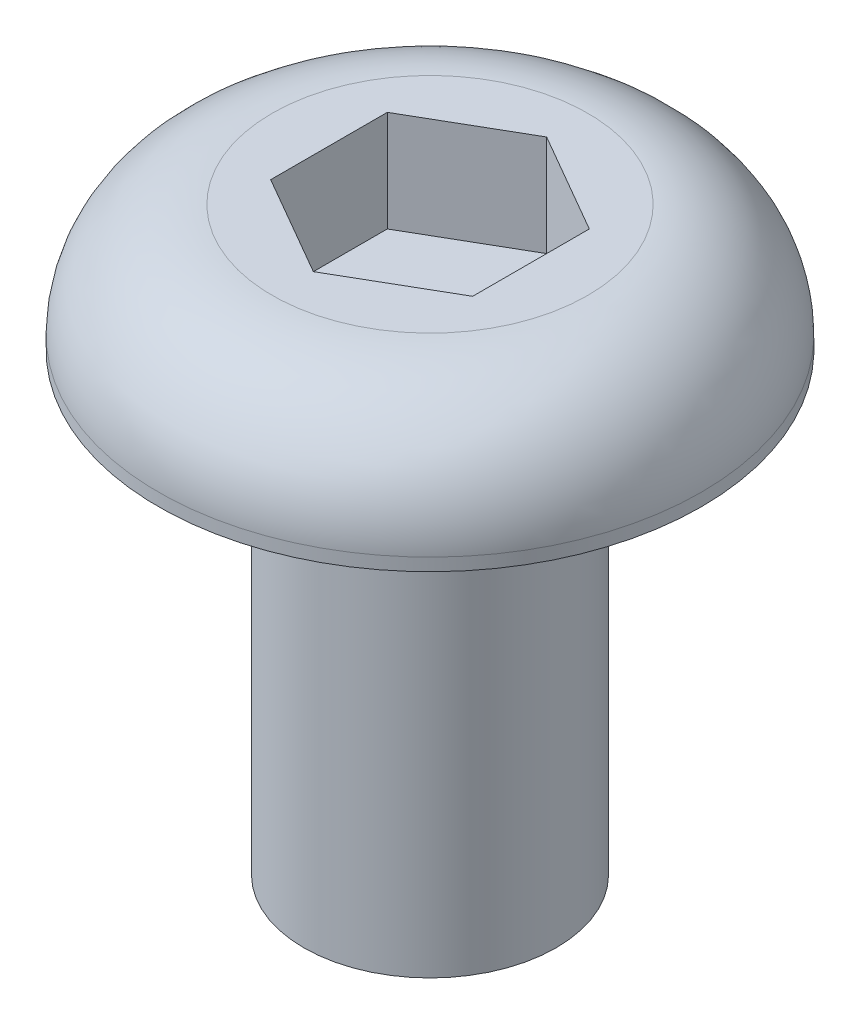
ISO-10303-21;
HEADER;
FILE_DESCRIPTION(('STEP AP214'),'2;1');
FILE_NAME('part.step','',(''),(''),'','','');
FILE_SCHEMA(('AUTOMOTIVE_DESIGN { 1 0 10303 214 1 1 1 1 }'));
ENDSEC;
DATA;
#1=APPLICATION_CONTEXT('core data for automotive mechanical design processes');
#2=APPLICATION_PROTOCOL_DEFINITION('international standard','automotive_design',2000,#1);
#3=PRODUCT_CONTEXT('',#1,'mechanical');
#4=PRODUCT('Part','Part','',(#3));
#5=PRODUCT_RELATED_PRODUCT_CATEGORY('part','',(#4));
#6=PRODUCT_DEFINITION_FORMATION('','',#4);
#7=PRODUCT_DEFINITION_CONTEXT('part definition',#1,'design');
#8=PRODUCT_DEFINITION('design','',#6,#7);
#9=PRODUCT_DEFINITION_SHAPE('','',#8);
#10=(LENGTH_UNIT() NAMED_UNIT(*) SI_UNIT(.MILLI.,.METRE.));
#11=(NAMED_UNIT(*) PLANE_ANGLE_UNIT() SI_UNIT($,.RADIAN.));
#12=(NAMED_UNIT(*) SI_UNIT($,.STERADIAN.) SOLID_ANGLE_UNIT());
#13=UNCERTAINTY_MEASURE_WITH_UNIT(LENGTH_MEASURE(1.E-05),#10,'distance_accuracy_value','');
#14=(GEOMETRIC_REPRESENTATION_CONTEXT(3) GLOBAL_UNCERTAINTY_ASSIGNED_CONTEXT((#13)) GLOBAL_UNIT_ASSIGNED_CONTEXT((#10,
#11,#12)) REPRESENTATION_CONTEXT('',''));
#15=CARTESIAN_POINT('',(0.,0.,0.));
#16=DIRECTION('',(0.,0.,1.));
#17=DIRECTION('',(1.,0.,0.));
#18=AXIS2_PLACEMENT_3D('',#15,#16,#17);
#19=CARTESIAN_POINT('',(0.,0.,0.));
#20=DIRECTION('',(0.,1.,0.));
#21=DIRECTION('',(-1.,0.,0.));
#22=AXIS2_PLACEMENT_3D('',#19,#20,#21);
#23=PLANE('',#22);
#24=CARTESIAN_POINT('',(0.,0.,0.));
#25=DIRECTION('',(0.,1.,0.));
#26=DIRECTION('',(-1.,0.,0.));
#27=AXIS2_PLACEMENT_3D('',#24,#25,#26);
#28=CIRCLE('',#27,5.);
#29=CARTESIAN_POINT('',(-5.,0.,0.));
#30=VERTEX_POINT('',#29);
#31=EDGE_CURVE('E11',#30,#30,#28,.T.);
#32=ORIENTED_EDGE('',*,*,#31,.F.);
#33=EDGE_LOOP('',(#32));
#34=FACE_BOUND('',#33,.T.);
#35=ADVANCED_FACE('F33',(#34),#23,.F.);
#36=CARTESIAN_POINT('',(0.,23.,0.));
#37=DIRECTION('',(0.,1.,0.));
#38=DIRECTION('',(-1.,0.,0.));
#39=AXIS2_PLACEMENT_3D('',#36,#37,#38);
#40=CYLINDRICAL_SURFACE('',#39,5.);
#41=CARTESIAN_POINT('',(0.,18.,0.));
#42=DIRECTION('',(0.,1.,0.));
#43=DIRECTION('',(-1.,0.,0.));
#44=AXIS2_PLACEMENT_3D('',#41,#42,#43);
#45=CIRCLE('',#44,5.);
#46=CARTESIAN_POINT('',(-5.,18.,0.));
#47=VERTEX_POINT('',#46);
#48=EDGE_CURVE('E40',#47,#47,#45,.T.);
#49=ORIENTED_EDGE('',*,*,#48,.F.);
#50=EDGE_LOOP('',(#49));
#51=FACE_BOUND('',#50,.T.);
#52=ORIENTED_EDGE('',*,*,#31,.T.);
#53=EDGE_LOOP('',(#52));
#54=FACE_BOUND('',#53,.T.);
#55=ADVANCED_FACE('F152',(#51,#54),#40,.T.);
#56=CARTESIAN_POINT('',(5.,18.,0.));
#57=DIRECTION('',(0.,1.,0.));
#58=DIRECTION('',(-1.,0.,0.));
#59=AXIS2_PLACEMENT_3D('',#56,#57,#58);
#60=PLANE('',#59);
#61=CARTESIAN_POINT('',(0.,18.,0.));
#62=DIRECTION('',(0.,1.,0.));
#63=DIRECTION('',(-1.,0.,0.));
#64=AXIS2_PLACEMENT_3D('',#61,#62,#63);
#65=CIRCLE('',#64,10.75);
#66=CARTESIAN_POINT('',(-10.75,18.,0.));
#67=VERTEX_POINT('',#66);
#68=EDGE_CURVE('E145',#67,#67,#65,.T.);
#69=ORIENTED_EDGE('',*,*,#68,.F.);
#70=EDGE_LOOP('',(#69));
#71=FACE_BOUND('',#70,.T.);
#72=ORIENTED_EDGE('',*,*,#48,.T.);
#73=EDGE_LOOP('',(#72));
#74=FACE_BOUND('',#73,.T.);
#75=ADVANCED_FACE('F150',(#71,#74),#60,.F.);
#76=CARTESIAN_POINT('',(0.,23.,0.));
#77=DIRECTION('',(0.,1.,0.));
#78=DIRECTION('',(-1.,0.,0.));
#79=AXIS2_PLACEMENT_3D('',#76,#77,#78);
#80=CYLINDRICAL_SURFACE('',#79,10.75);
#81=CARTESIAN_POINT('',(0.,18.5,0.));
#82=DIRECTION('',(0.,1.,0.));
#83=DIRECTION('',(-1.,0.,0.));
#84=AXIS2_PLACEMENT_3D('',#81,#82,#83);
#85=CIRCLE('',#84,10.75);
#86=CARTESIAN_POINT('',(-10.75,18.5,0.));
#87=VERTEX_POINT('',#86);
#88=EDGE_CURVE('E142',#87,#87,#85,.T.);
#89=ORIENTED_EDGE('',*,*,#88,.F.);
#90=EDGE_LOOP('',(#89));
#91=FACE_BOUND('',#90,.T.);
#92=ORIENTED_EDGE('',*,*,#68,.T.);
#93=EDGE_LOOP('',(#92));
#94=FACE_BOUND('',#93,.T.);
#95=ADVANCED_FACE('F170',(#91,#94),#80,.T.);
#96=CARTESIAN_POINT('',(0.,18.5,0.));
#97=DIRECTION('',(0.,1.,0.));
#98=DIRECTION('',(-1.,0.,0.));
#99=AXIS2_PLACEMENT_3D('',#96,#97,#98);
#100=TOROIDAL_SURFACE('',#99,6.25,4.5);
#101=CARTESIAN_POINT('',(0.,23.,0.));
#102=DIRECTION('',(0.,1.,0.));
#103=DIRECTION('',(-1.,0.,0.));
#104=AXIS2_PLACEMENT_3D('',#101,#102,#103);
#105=CIRCLE('',#104,6.25);
#106=CARTESIAN_POINT('',(-6.25000000000001,23.,0.));
#107=VERTEX_POINT('',#106);
#108=EDGE_CURVE('E134',#107,#107,#105,.T.);
#109=ORIENTED_EDGE('',*,*,#108,.F.);
#110=EDGE_LOOP('',(#109));
#111=FACE_BOUND('',#110,.T.);
#112=ORIENTED_EDGE('',*,*,#88,.T.);
#113=EDGE_LOOP('',(#112));
#114=FACE_BOUND('',#113,.T.);
#115=ADVANCED_FACE('F178',(#111,#114),#100,.T.);
#116=CARTESIAN_POINT('',(6.25,23.,0.));
#117=DIRECTION('',(0.,-1.,0.));
#118=DIRECTION('',(1.,0.,0.));
#119=AXIS2_PLACEMENT_3D('',#116,#117,#118);
#120=PLANE('',#119);
#121=DIRECTION('',(-0.866025403784439,0.,0.5));
#122=VECTOR('',#121,1.);
#123=CARTESIAN_POINT('',(0.,23.,-4.61880215351701));
#124=LINE('',#123,#122);
#125=CARTESIAN_POINT('',(0.,23.,-4.61880215351701));
#126=VERTEX_POINT('',#125);
#127=CARTESIAN_POINT('',(-4.,23.,-2.3094010767585));
#128=VERTEX_POINT('',#127);
#129=EDGE_CURVE('E121',#126,#128,#124,.T.);
#130=ORIENTED_EDGE('',*,*,#129,.F.);
#131=DIRECTION('',(-0.866025403784439,0.,-0.5));
#132=VECTOR('',#131,1.);
#133=CARTESIAN_POINT('',(4.,23.,-2.3094010767585));
#134=LINE('',#133,#132);
#135=CARTESIAN_POINT('',(4.,23.,-2.3094010767585));
#136=VERTEX_POINT('',#135);
#137=EDGE_CURVE('E47',#136,#126,#134,.T.);
#138=ORIENTED_EDGE('',*,*,#137,.F.);
#139=DIRECTION('',(0.,0.,-1.));
#140=VECTOR('',#139,1.);
#141=CARTESIAN_POINT('',(4.,23.,2.3094010767585));
#142=LINE('',#141,#140);
#143=CARTESIAN_POINT('',(4.,23.,2.3094010767585));
#144=VERTEX_POINT('',#143);
#145=EDGE_CURVE('E130',#144,#136,#142,.T.);
#146=ORIENTED_EDGE('',*,*,#145,.F.);
#147=DIRECTION('',(0.866025403784439,0.,-0.5));
#148=VECTOR('',#147,1.);
#149=CARTESIAN_POINT('',(0.,23.,4.61880215351701));
#150=LINE('',#149,#148);
#151=CARTESIAN_POINT('',(0.,23.,4.61880215351701));
#152=VERTEX_POINT('',#151);
#153=EDGE_CURVE('E128',#152,#144,#150,.T.);
#154=ORIENTED_EDGE('',*,*,#153,.F.);
#155=DIRECTION('',(0.866025403784439,0.,0.5));
#156=VECTOR('',#155,1.);
#157=CARTESIAN_POINT('',(-4.,23.,2.30940107675851));
#158=LINE('',#157,#156);
#159=CARTESIAN_POINT('',(-4.,23.,2.30940107675851));
#160=VERTEX_POINT('',#159);
#161=EDGE_CURVE('E95',#160,#152,#158,.T.);
#162=ORIENTED_EDGE('',*,*,#161,.F.);
#163=DIRECTION('',(0.,0.,1.));
#164=VECTOR('',#163,1.);
#165=CARTESIAN_POINT('',(-4.,23.,-2.3094010767585));
#166=LINE('',#165,#164);
#167=EDGE_CURVE('E124',#128,#160,#166,.T.);
#168=ORIENTED_EDGE('',*,*,#167,.F.);
#169=EDGE_LOOP('',(#130,#138,#146,#154,#162,#168));
#170=FACE_BOUND('',#169,.T.);
#171=ORIENTED_EDGE('',*,*,#108,.T.);
#172=EDGE_LOOP('',(#171));
#173=FACE_BOUND('',#172,.T.);
#174=ADVANCED_FACE('F186',(#170,#173),#120,.F.);
#175=CARTESIAN_POINT('',(4.,19.,-2.3094010767585));
#176=DIRECTION('',(0.5,0.,-0.866025403784439));
#177=DIRECTION('',(-0.866025403784439,0.,-0.5));
#178=AXIS2_PLACEMENT_3D('',#175,#176,#177);
#179=PLANE('',#178);
#180=ORIENTED_EDGE('',*,*,#137,.T.);
#181=DIRECTION('',(0.,1.,0.));
#182=VECTOR('',#181,1.);
#183=CARTESIAN_POINT('',(0.,19.,-4.61880215351701));
#184=LINE('',#183,#182);
#185=CARTESIAN_POINT('',(0.,19.,-4.61880215351701));
#186=VERTEX_POINT('',#185);
#187=EDGE_CURVE('E77',#186,#126,#184,.T.);
#188=ORIENTED_EDGE('',*,*,#187,.F.);
#189=DIRECTION('',(-0.866025403784439,0.,-0.5));
#190=VECTOR('',#189,1.);
#191=CARTESIAN_POINT('',(4.,19.,-2.3094010767585));
#192=LINE('',#191,#190);
#193=CARTESIAN_POINT('',(4.,19.,-2.3094010767585));
#194=VERTEX_POINT('',#193);
#195=EDGE_CURVE('E132',#194,#186,#192,.T.);
#196=ORIENTED_EDGE('',*,*,#195,.F.);
#197=DIRECTION('',(0.,1.,0.));
#198=VECTOR('',#197,1.);
#199=CARTESIAN_POINT('',(4.,19.,-2.3094010767585));
#200=LINE('',#199,#198);
#201=EDGE_CURVE('E55',#194,#136,#200,.T.);
#202=ORIENTED_EDGE('',*,*,#201,.T.);
#203=EDGE_LOOP('',(#180,#188,#196,#202));
#204=FACE_BOUND('',#203,.T.);
#205=ADVANCED_FACE('F194',(#204),#179,.F.);
#206=CARTESIAN_POINT('',(4.,19.,2.3094010767585));
#207=DIRECTION('',(1.,0.,0.));
#208=DIRECTION('',(0.,0.,-1.));
#209=AXIS2_PLACEMENT_3D('',#206,#207,#208);
#210=PLANE('',#209);
#211=ORIENTED_EDGE('',*,*,#145,.T.);
#212=ORIENTED_EDGE('',*,*,#201,.F.);
#213=DIRECTION('',(0.,0.,-1.));
#214=VECTOR('',#213,1.);
#215=CARTESIAN_POINT('',(4.,19.,2.3094010767585));
#216=LINE('',#215,#214);
#217=CARTESIAN_POINT('',(4.,19.,2.3094010767585));
#218=VERTEX_POINT('',#217);
#219=EDGE_CURVE('E107',#218,#194,#216,.T.);
#220=ORIENTED_EDGE('',*,*,#219,.F.);
#221=DIRECTION('',(0.,1.,0.));
#222=VECTOR('',#221,1.);
#223=CARTESIAN_POINT('',(4.,19.,2.3094010767585));
#224=LINE('',#223,#222);
#225=EDGE_CURVE('E99',#218,#144,#224,.T.);
#226=ORIENTED_EDGE('',*,*,#225,.T.);
#227=EDGE_LOOP('',(#211,#212,#220,#226));
#228=FACE_BOUND('',#227,.T.);
#229=ADVANCED_FACE('F202',(#228),#210,.F.);
#230=CARTESIAN_POINT('',(0.,19.,4.61880215351701));
#231=DIRECTION('',(0.5,0.,0.866025403784439));
#232=DIRECTION('',(0.866025403784439,0.,-0.5));
#233=AXIS2_PLACEMENT_3D('',#230,#231,#232);
#234=PLANE('',#233);
#235=ORIENTED_EDGE('',*,*,#153,.T.);
#236=ORIENTED_EDGE('',*,*,#225,.F.);
#237=DIRECTION('',(0.866025403784439,0.,-0.5));
#238=VECTOR('',#237,1.);
#239=CARTESIAN_POINT('',(0.,19.,4.61880215351701));
#240=LINE('',#239,#238);
#241=CARTESIAN_POINT('',(0.,19.,4.61880215351701));
#242=VERTEX_POINT('',#241);
#243=EDGE_CURVE('E103',#242,#218,#240,.T.);
#244=ORIENTED_EDGE('',*,*,#243,.F.);
#245=DIRECTION('',(0.,1.,0.));
#246=VECTOR('',#245,1.);
#247=CARTESIAN_POINT('',(0.,19.,4.61880215351701));
#248=LINE('',#247,#246);
#249=EDGE_CURVE('E88',#242,#152,#248,.T.);
#250=ORIENTED_EDGE('',*,*,#249,.T.);
#251=EDGE_LOOP('',(#235,#236,#244,#250));
#252=FACE_BOUND('',#251,.T.);
#253=ADVANCED_FACE('F104',(#252),#234,.F.);
#254=CARTESIAN_POINT('',(-4.,19.,2.30940107675851));
#255=DIRECTION('',(-0.5,0.,0.866025403784439));
#256=DIRECTION('',(0.866025403784439,0.,0.5));
#257=AXIS2_PLACEMENT_3D('',#254,#255,#256);
#258=PLANE('',#257);
#259=ORIENTED_EDGE('',*,*,#161,.T.);
#260=ORIENTED_EDGE('',*,*,#249,.F.);
#261=DIRECTION('',(0.866025403784439,0.,0.5));
#262=VECTOR('',#261,1.);
#263=CARTESIAN_POINT('',(-4.,19.,2.30940107675851));
#264=LINE('',#263,#262);
#265=CARTESIAN_POINT('',(-4.,19.,2.30940107675851));
#266=VERTEX_POINT('',#265);
#267=EDGE_CURVE('E92',#266,#242,#264,.T.);
#268=ORIENTED_EDGE('',*,*,#267,.F.);
#269=DIRECTION('',(0.,1.,0.));
#270=VECTOR('',#269,1.);
#271=CARTESIAN_POINT('',(-4.,19.,2.30940107675851));
#272=LINE('',#271,#270);
#273=EDGE_CURVE('E100',#266,#160,#272,.T.);
#274=ORIENTED_EDGE('',*,*,#273,.T.);
#275=EDGE_LOOP('',(#259,#260,#268,#274));
#276=FACE_BOUND('',#275,.T.);
#277=ADVANCED_FACE('F90',(#276),#258,.F.);
#278=CARTESIAN_POINT('',(-4.,19.,-2.3094010767585));
#279=DIRECTION('',(-1.,0.,0.));
#280=DIRECTION('',(0.,0.,1.));
#281=AXIS2_PLACEMENT_3D('',#278,#279,#280);
#282=PLANE('',#281);
#283=ORIENTED_EDGE('',*,*,#167,.T.);
#284=ORIENTED_EDGE('',*,*,#273,.F.);
#285=DIRECTION('',(0.,0.,1.));
#286=VECTOR('',#285,1.);
#287=CARTESIAN_POINT('',(-4.,19.,-2.3094010767585));
#288=LINE('',#287,#286);
#289=CARTESIAN_POINT('',(-4.,19.,-2.3094010767585));
#290=VERTEX_POINT('',#289);
#291=EDGE_CURVE('E113',#290,#266,#288,.T.);
#292=ORIENTED_EDGE('',*,*,#291,.F.);
#293=DIRECTION('',(0.,1.,0.));
#294=VECTOR('',#293,1.);
#295=CARTESIAN_POINT('',(-4.,19.,-2.3094010767585));
#296=LINE('',#295,#294);
#297=EDGE_CURVE('E137',#290,#128,#296,.T.);
#298=ORIENTED_EDGE('',*,*,#297,.T.);
#299=EDGE_LOOP('',(#283,#284,#292,#298));
#300=FACE_BOUND('',#299,.T.);
#301=ADVANCED_FACE('F221',(#300),#282,.F.);
#302=CARTESIAN_POINT('',(0.,19.,-4.61880215351701));
#303=DIRECTION('',(-0.5,0.,-0.866025403784439));
#304=DIRECTION('',(-0.866025403784439,0.,0.5));
#305=AXIS2_PLACEMENT_3D('',#302,#303,#304);
#306=PLANE('',#305);
#307=ORIENTED_EDGE('',*,*,#129,.T.);
#308=ORIENTED_EDGE('',*,*,#297,.F.);
#309=DIRECTION('',(-0.866025403784439,0.,0.5));
#310=VECTOR('',#309,1.);
#311=CARTESIAN_POINT('',(0.,19.,-4.61880215351701));
#312=LINE('',#311,#310);
#313=EDGE_CURVE('E115',#186,#290,#312,.T.);
#314=ORIENTED_EDGE('',*,*,#313,.F.);
#315=ORIENTED_EDGE('',*,*,#187,.T.);
#316=EDGE_LOOP('',(#307,#308,#314,#315));
#317=FACE_BOUND('',#316,.T.);
#318=ADVANCED_FACE('F228',(#317),#306,.F.);
#319=CARTESIAN_POINT('',(0.,19.,0.));
#320=DIRECTION('',(0.,1.,0.));
#321=DIRECTION('',(0.,0.,1.));
#322=AXIS2_PLACEMENT_3D('',#319,#320,#321);
#323=PLANE('',#322);
#324=ORIENTED_EDGE('',*,*,#195,.T.);
#325=ORIENTED_EDGE('',*,*,#313,.T.);
#326=ORIENTED_EDGE('',*,*,#291,.T.);
#327=ORIENTED_EDGE('',*,*,#267,.T.);
#328=ORIENTED_EDGE('',*,*,#243,.T.);
#329=ORIENTED_EDGE('',*,*,#219,.T.);
#330=EDGE_LOOP('',(#324,#325,#326,#327,#328,#329));
#331=FACE_BOUND('',#330,.T.);
#332=ADVANCED_FACE('F110',(#331),#323,.T.);
#333=CLOSED_SHELL('',(#35,#55,#75,#95,#115,#174,#205,#229,#253,#277,#301,#318,#332));
#334=MANIFOLD_SOLID_BREP('B2',#333);
#335=ADVANCED_BREP_SHAPE_REPRESENTATION('',(#18,#334),#14);
#336=SHAPE_DEFINITION_REPRESENTATION(#9,#335);
ENDSEC;
END-ISO-10303-21;
